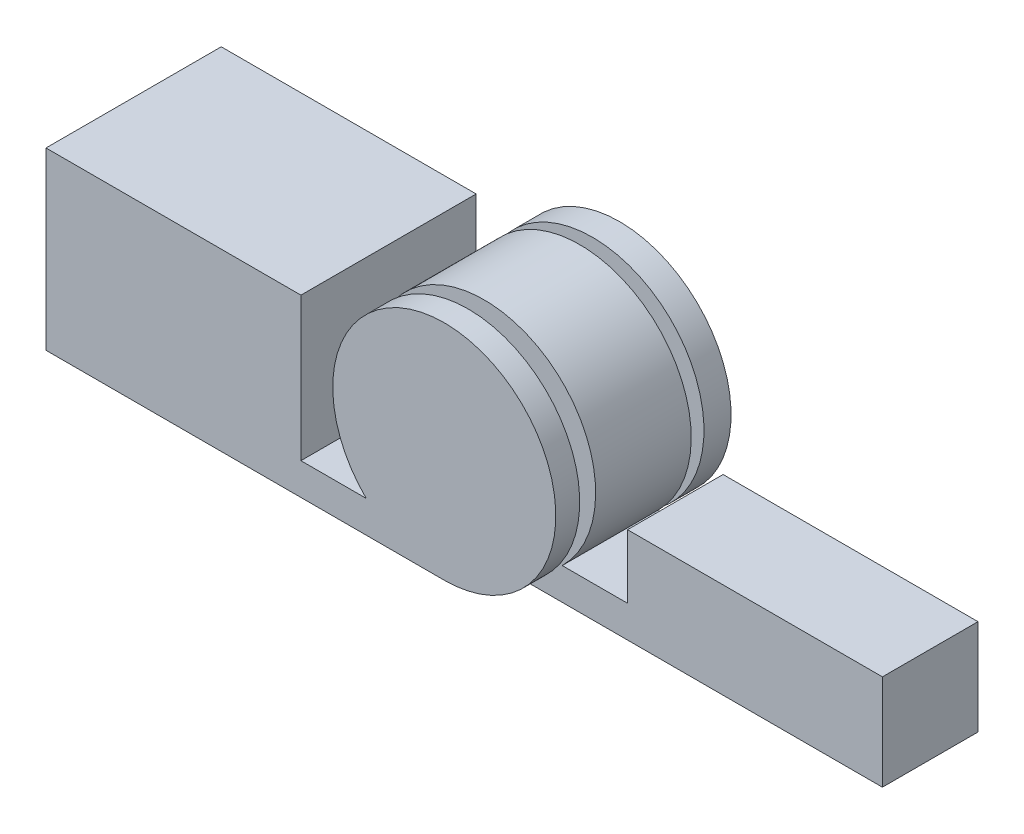
ISO-10303-21;
HEADER;
FILE_DESCRIPTION(('STEP AP214'),'2;1');
FILE_NAME('part.step','',(''),(''),'','','');
FILE_SCHEMA(('AUTOMOTIVE_DESIGN { 1 0 10303 214 1 1 1 1 }'));
ENDSEC;
DATA;
#1=APPLICATION_CONTEXT('core data for automotive mechanical design processes');
#2=APPLICATION_PROTOCOL_DEFINITION('international standard','automotive_design',2000,#1);
#3=PRODUCT_CONTEXT('',#1,'mechanical');
#4=PRODUCT('Part','Part','',(#3));
#5=PRODUCT_RELATED_PRODUCT_CATEGORY('part','',(#4));
#6=PRODUCT_DEFINITION_FORMATION('','',#4);
#7=PRODUCT_DEFINITION_CONTEXT('part definition',#1,'design');
#8=PRODUCT_DEFINITION('design','',#6,#7);
#9=PRODUCT_DEFINITION_SHAPE('','',#8);
#10=(LENGTH_UNIT() NAMED_UNIT(*) SI_UNIT(.MILLI.,.METRE.));
#11=(NAMED_UNIT(*) PLANE_ANGLE_UNIT() SI_UNIT($,.RADIAN.));
#12=(NAMED_UNIT(*) SI_UNIT($,.STERADIAN.) SOLID_ANGLE_UNIT());
#13=UNCERTAINTY_MEASURE_WITH_UNIT(LENGTH_MEASURE(1.E-05),#10,'distance_accuracy_value','');
#14=(GEOMETRIC_REPRESENTATION_CONTEXT(3) GLOBAL_UNCERTAINTY_ASSIGNED_CONTEXT((#13)) GLOBAL_UNIT_ASSIGNED_CONTEXT((#10,
#11,#12)) REPRESENTATION_CONTEXT('',''));
#15=CARTESIAN_POINT('',(0.,0.,0.));
#16=DIRECTION('',(0.,0.,1.));
#17=DIRECTION('',(1.,0.,0.));
#18=AXIS2_PLACEMENT_3D('',#15,#16,#17);
#19=CARTESIAN_POINT('',(317.5,88.9,-251.447171389936));
#20=DIRECTION('',(0.,0.,1.));
#21=DIRECTION('',(1.,0.,0.));
#22=AXIS2_PLACEMENT_3D('',#19,#20,#21);
#23=CYLINDRICAL_SURFACE('',#22,88.9);
#24=CARTESIAN_POINT('',(317.5,88.9,31.75));
#25=DIRECTION('',(0.,0.,1.));
#26=DIRECTION('',(1.,0.,0.));
#27=AXIS2_PLACEMENT_3D('',#24,#25,#26);
#28=CIRCLE('',#27,88.9);
#29=CARTESIAN_POINT('',(317.5,0.,31.75));
#30=VERTEX_POINT('',#29);
#31=CARTESIAN_POINT('',(255.282960533307,25.3999999999999,31.75));
#32=VERTEX_POINT('',#31);
#33=EDGE_CURVE('E43',#30,#32,#28,.F.);
#34=ORIENTED_EDGE('',*,*,#33,.F.);
#35=DIRECTION('',(0.,0.,1.));
#36=VECTOR('',#35,1.);
#37=CARTESIAN_POINT('',(317.5,0.,-251.447171389936));
#38=LINE('',#37,#36);
#39=CARTESIAN_POINT('',(317.5,0.,21.59));
#40=VERTEX_POINT('',#39);
#41=EDGE_CURVE('E159',#40,#30,#38,.T.);
#42=ORIENTED_EDGE('',*,*,#41,.F.);
#43=CARTESIAN_POINT('',(317.5,88.9,21.59));
#44=DIRECTION('',(0.,0.,1.));
#45=DIRECTION('',(1.,0.,0.));
#46=AXIS2_PLACEMENT_3D('',#43,#44,#45);
#47=CIRCLE('',#46,88.9);
#48=CARTESIAN_POINT('',(255.282960533307,25.3999999999999,21.59));
#49=VERTEX_POINT('',#48);
#50=EDGE_CURVE('E201',#40,#49,#47,.F.);
#51=ORIENTED_EDGE('',*,*,#50,.T.);
#52=DIRECTION('',(0.,0.,-1.));
#53=VECTOR('',#52,1.);
#54=CARTESIAN_POINT('',(255.282960533307,25.3999999999999,139.7));
#55=LINE('',#54,#53);
#56=EDGE_CURVE('E247',#32,#49,#55,.T.);
#57=ORIENTED_EDGE('',*,*,#56,.F.);
#58=EDGE_LOOP('',(#34,#42,#51,#57));
#59=FACE_BOUND('',#58,.T.);
#60=ADVANCED_FACE('F35',(#59),#23,.F.);
#61=CARTESIAN_POINT('',(317.5,88.9,139.7));
#62=DIRECTION('',(0.,0.,-1.));
#63=DIRECTION('',(-1.,0.,0.));
#64=AXIS2_PLACEMENT_3D('',#61,#62,#63);
#65=CYLINDRICAL_SURFACE('',#64,88.9);
#66=EDGE_CURVE('E200',#49,#40,#47,.F.);
#67=ORIENTED_EDGE('',*,*,#66,.T.);
#68=DIRECTION('',(0.,0.,-1.));
#69=VECTOR('',#68,1.);
#70=CARTESIAN_POINT('',(317.5,0.,139.7));
#71=LINE('',#70,#69);
#72=CARTESIAN_POINT('',(317.5,0.,0.));
#73=VERTEX_POINT('',#72);
#74=EDGE_CURVE('E245',#40,#73,#71,.T.);
#75=ORIENTED_EDGE('',*,*,#74,.T.);
#76=CARTESIAN_POINT('',(317.5,88.9,0.));
#77=DIRECTION('',(0.,0.,1.));
#78=DIRECTION('',(1.,0.,0.));
#79=AXIS2_PLACEMENT_3D('',#76,#77,#78);
#80=CIRCLE('',#79,88.9);
#81=CARTESIAN_POINT('',(255.282960533307,25.3999999999999,0.));
#82=VERTEX_POINT('',#81);
#83=EDGE_CURVE('E225',#73,#82,#80,.T.);
#84=ORIENTED_EDGE('',*,*,#83,.T.);
#85=EDGE_CURVE('E241',#49,#82,#55,.T.);
#86=ORIENTED_EDGE('',*,*,#85,.F.);
#87=EDGE_LOOP('',(#67,#75,#84,#86));
#88=FACE_BOUND('',#87,.T.);
#89=ADVANCED_FACE('F303',(#88),#65,.T.);
#90=CARTESIAN_POINT('',(0.,0.,139.7));
#91=DIRECTION('',(1.,0.,0.));
#92=DIRECTION('',(0.,0.,-1.));
#93=AXIS2_PLACEMENT_3D('',#90,#91,#92);
#94=PLANE('',#93);
#95=DIRECTION('',(0.,-1.,0.));
#96=VECTOR('',#95,1.);
#97=CARTESIAN_POINT('',(0.,0.,0.));
#98=LINE('',#97,#96);
#99=CARTESIAN_POINT('',(0.,139.7,0.));
#100=VERTEX_POINT('',#99);
#101=CARTESIAN_POINT('',(0.,0.,0.));
#102=VERTEX_POINT('',#101);
#103=EDGE_CURVE('E205',#100,#102,#98,.T.);
#104=ORIENTED_EDGE('',*,*,#103,.T.);
#105=DIRECTION('',(0.,0.,-1.));
#106=VECTOR('',#105,1.);
#107=CARTESIAN_POINT('',(0.,0.,139.7));
#108=LINE('',#107,#106);
#109=CARTESIAN_POINT('',(0.,0.,139.7));
#110=VERTEX_POINT('',#109);
#111=EDGE_CURVE('E251',#110,#102,#108,.T.);
#112=ORIENTED_EDGE('',*,*,#111,.F.);
#113=DIRECTION('',(0.,-1.,0.));
#114=VECTOR('',#113,1.);
#115=CARTESIAN_POINT('',(0.,0.,139.7));
#116=LINE('',#115,#114);
#117=CARTESIAN_POINT('',(0.,139.7,139.7));
#118=VERTEX_POINT('',#117);
#119=EDGE_CURVE('E206',#118,#110,#116,.T.);
#120=ORIENTED_EDGE('',*,*,#119,.F.);
#121=DIRECTION('',(0.,0.,-1.));
#122=VECTOR('',#121,1.);
#123=CARTESIAN_POINT('',(0.,139.7,139.7));
#124=LINE('',#123,#122);
#125=EDGE_CURVE('E220',#118,#100,#124,.T.);
#126=ORIENTED_EDGE('',*,*,#125,.T.);
#127=EDGE_LOOP('',(#104,#112,#120,#126));
#128=FACE_BOUND('',#127,.T.);
#129=ADVANCED_FACE('F37',(#128),#94,.F.);
#130=CARTESIAN_POINT('',(203.2,0.,139.7));
#131=DIRECTION('',(0.,1.,0.));
#132=DIRECTION('',(0.,0.,1.));
#133=AXIS2_PLACEMENT_3D('',#130,#131,#132);
#134=PLANE('',#133);
#135=DIRECTION('',(1.,0.,0.));
#136=VECTOR('',#135,1.);
#137=CARTESIAN_POINT('',(203.2,0.,0.));
#138=LINE('',#137,#136);
#139=EDGE_CURVE('E223',#102,#73,#138,.T.);
#140=ORIENTED_EDGE('',*,*,#139,.T.);
#141=ORIENTED_EDGE('',*,*,#74,.F.);
#142=ORIENTED_EDGE('',*,*,#41,.T.);
#143=DIRECTION('',(1.,0.,0.));
#144=VECTOR('',#143,1.);
#145=CARTESIAN_POINT('',(317.5,0.,31.75));
#146=LINE('',#145,#144);
#147=CARTESIAN_POINT('',(635.,0.,31.75));
#148=VERTEX_POINT('',#147);
#149=EDGE_CURVE('E155',#30,#148,#146,.T.);
#150=ORIENTED_EDGE('',*,*,#149,.T.);
#151=DIRECTION('',(0.,0.,-1.));
#152=VECTOR('',#151,1.);
#153=CARTESIAN_POINT('',(635.,0.,107.95));
#154=LINE('',#153,#152);
#155=CARTESIAN_POINT('',(635.,0.,107.95));
#156=VERTEX_POINT('',#155);
#157=EDGE_CURVE('E142',#156,#148,#154,.T.);
#158=ORIENTED_EDGE('',*,*,#157,.F.);
#159=DIRECTION('',(1.,0.,0.));
#160=VECTOR('',#159,1.);
#161=CARTESIAN_POINT('',(317.5,0.,107.95));
#162=LINE('',#161,#160);
#163=CARTESIAN_POINT('',(317.5,0.,107.95));
#164=VERTEX_POINT('',#163);
#165=EDGE_CURVE('E182',#164,#156,#162,.T.);
#166=ORIENTED_EDGE('',*,*,#165,.F.);
#167=CARTESIAN_POINT('',(317.5,0.,120.65));
#168=VERTEX_POINT('',#167);
#169=EDGE_CURVE('E49',#164,#168,#38,.T.);
#170=ORIENTED_EDGE('',*,*,#169,.T.);
#171=CARTESIAN_POINT('',(317.5,0.,139.7));
#172=VERTEX_POINT('',#171);
#173=EDGE_CURVE('E248',#172,#168,#71,.T.);
#174=ORIENTED_EDGE('',*,*,#173,.F.);
#175=DIRECTION('',(1.,0.,0.));
#176=VECTOR('',#175,1.);
#177=CARTESIAN_POINT('',(0.,0.,139.7));
#178=LINE('',#177,#176);
#179=EDGE_CURVE('E209',#110,#172,#178,.T.);
#180=ORIENTED_EDGE('',*,*,#179,.F.);
#181=ORIENTED_EDGE('',*,*,#111,.T.);
#182=EDGE_LOOP('',(#140,#141,#142,#150,#158,#166,#170,#174,#180,#181));
#183=FACE_BOUND('',#182,.T.);
#184=ADVANCED_FACE('F157',(#183),#134,.F.);
#185=ORIENTED_EDGE('',*,*,#173,.T.);
#186=CARTESIAN_POINT('',(317.5,88.9,120.65));
#187=DIRECTION('',(0.,0.,1.));
#188=DIRECTION('',(1.,0.,0.));
#189=AXIS2_PLACEMENT_3D('',#186,#187,#188);
#190=CIRCLE('',#189,88.9);
#191=CARTESIAN_POINT('',(255.282960533307,25.4,120.65));
#192=VERTEX_POINT('',#191);
#193=EDGE_CURVE('E151',#168,#192,#190,.T.);
#194=ORIENTED_EDGE('',*,*,#193,.T.);
#195=CARTESIAN_POINT('',(255.282960533307,25.3999999999999,139.7));
#196=VERTEX_POINT('',#195);
#197=EDGE_CURVE('E242',#196,#192,#55,.T.);
#198=ORIENTED_EDGE('',*,*,#197,.F.);
#199=CARTESIAN_POINT('',(317.5,88.9,139.7));
#200=DIRECTION('',(0.,0.,1.));
#201=DIRECTION('',(1.,0.,0.));
#202=AXIS2_PLACEMENT_3D('',#199,#200,#201);
#203=CIRCLE('',#202,88.9);
#204=EDGE_CURVE('E212',#172,#196,#203,.T.);
#205=ORIENTED_EDGE('',*,*,#204,.F.);
#206=EDGE_LOOP('',(#185,#194,#198,#205));
#207=FACE_BOUND('',#206,.T.);
#208=ADVANCED_FACE('F284',(#207),#65,.T.);
#209=CARTESIAN_POINT('',(203.2,25.4,139.7));
#210=DIRECTION('',(0.,-1.,0.));
#211=DIRECTION('',(1.,0.,0.));
#212=AXIS2_PLACEMENT_3D('',#209,#210,#211);
#213=PLANE('',#212);
#214=DIRECTION('',(-1.,0.,0.));
#215=VECTOR('',#214,1.);
#216=CARTESIAN_POINT('',(203.2,25.4,0.));
#217=LINE('',#216,#215);
#218=CARTESIAN_POINT('',(203.2,25.4,0.));
#219=VERTEX_POINT('',#218);
#220=EDGE_CURVE('E228',#82,#219,#217,.T.);
#221=ORIENTED_EDGE('',*,*,#220,.T.);
#222=DIRECTION('',(0.,0.,-1.));
#223=VECTOR('',#222,1.);
#224=CARTESIAN_POINT('',(203.2,25.4,139.7));
#225=LINE('',#224,#223);
#226=CARTESIAN_POINT('',(203.2,25.4,139.7));
#227=VERTEX_POINT('',#226);
#228=EDGE_CURVE('E238',#227,#219,#225,.T.);
#229=ORIENTED_EDGE('',*,*,#228,.F.);
#230=DIRECTION('',(-1.,0.,0.));
#231=VECTOR('',#230,1.);
#232=CARTESIAN_POINT('',(203.2,25.4,139.7));
#233=LINE('',#232,#231);
#234=EDGE_CURVE('E214',#196,#227,#233,.T.);
#235=ORIENTED_EDGE('',*,*,#234,.F.);
#236=ORIENTED_EDGE('',*,*,#197,.T.);
#237=CARTESIAN_POINT('',(255.282960533307,25.3999999999999,107.95));
#238=VERTEX_POINT('',#237);
#239=EDGE_CURVE('E246',#192,#238,#55,.T.);
#240=ORIENTED_EDGE('',*,*,#239,.T.);
#241=EDGE_CURVE('E259',#238,#32,#55,.T.);
#242=ORIENTED_EDGE('',*,*,#241,.T.);
#243=ORIENTED_EDGE('',*,*,#56,.T.);
#244=ORIENTED_EDGE('',*,*,#85,.T.);
#245=EDGE_LOOP('',(#221,#229,#235,#236,#240,#242,#243,#244));
#246=FACE_BOUND('',#245,.T.);
#247=ADVANCED_FACE('F309',(#246),#213,.F.);
#248=CARTESIAN_POINT('',(203.2,25.4,139.7));
#249=DIRECTION('',(-1.,0.,0.));
#250=DIRECTION('',(0.,0.,1.));
#251=AXIS2_PLACEMENT_3D('',#248,#249,#250);
#252=PLANE('',#251);
#253=DIRECTION('',(0.,1.,0.));
#254=VECTOR('',#253,1.);
#255=CARTESIAN_POINT('',(203.2,25.4,0.));
#256=LINE('',#255,#254);
#257=CARTESIAN_POINT('',(203.2,139.7,0.));
#258=VERTEX_POINT('',#257);
#259=EDGE_CURVE('E230',#219,#258,#256,.T.);
#260=ORIENTED_EDGE('',*,*,#259,.T.);
#261=DIRECTION('',(0.,0.,-1.));
#262=VECTOR('',#261,1.);
#263=CARTESIAN_POINT('',(203.2,139.7,139.7));
#264=LINE('',#263,#262);
#265=CARTESIAN_POINT('',(203.2,139.7,139.7));
#266=VERTEX_POINT('',#265);
#267=EDGE_CURVE('E235',#266,#258,#264,.T.);
#268=ORIENTED_EDGE('',*,*,#267,.F.);
#269=DIRECTION('',(0.,1.,0.));
#270=VECTOR('',#269,1.);
#271=CARTESIAN_POINT('',(203.2,25.4,139.7));
#272=LINE('',#271,#270);
#273=EDGE_CURVE('E216',#227,#266,#272,.T.);
#274=ORIENTED_EDGE('',*,*,#273,.F.);
#275=ORIENTED_EDGE('',*,*,#228,.T.);
#276=EDGE_LOOP('',(#260,#268,#274,#275));
#277=FACE_BOUND('',#276,.T.);
#278=ADVANCED_FACE('F313',(#277),#252,.F.);
#279=CARTESIAN_POINT('',(0.,139.7,139.7));
#280=DIRECTION('',(0.,-1.,0.));
#281=DIRECTION('',(0.,0.,-1.));
#282=AXIS2_PLACEMENT_3D('',#279,#280,#281);
#283=PLANE('',#282);
#284=DIRECTION('',(-1.,0.,0.));
#285=VECTOR('',#284,1.);
#286=CARTESIAN_POINT('',(0.,139.7,0.));
#287=LINE('',#286,#285);
#288=EDGE_CURVE('E210',#258,#100,#287,.T.);
#289=ORIENTED_EDGE('',*,*,#288,.T.);
#290=ORIENTED_EDGE('',*,*,#125,.F.);
#291=DIRECTION('',(-1.,0.,0.));
#292=VECTOR('',#291,1.);
#293=CARTESIAN_POINT('',(0.,139.7,139.7));
#294=LINE('',#293,#292);
#295=EDGE_CURVE('E218',#266,#118,#294,.T.);
#296=ORIENTED_EDGE('',*,*,#295,.F.);
#297=ORIENTED_EDGE('',*,*,#267,.T.);
#298=EDGE_LOOP('',(#289,#290,#296,#297));
#299=FACE_BOUND('',#298,.T.);
#300=ADVANCED_FACE('F316',(#299),#283,.F.);
#301=CARTESIAN_POINT('',(317.5,88.9,139.7));
#302=DIRECTION('',(0.,0.,1.));
#303=DIRECTION('',(1.,0.,0.));
#304=AXIS2_PLACEMENT_3D('',#301,#302,#303);
#305=PLANE('',#304);
#306=ORIENTED_EDGE('',*,*,#119,.T.);
#307=ORIENTED_EDGE('',*,*,#179,.T.);
#308=ORIENTED_EDGE('',*,*,#204,.T.);
#309=ORIENTED_EDGE('',*,*,#234,.T.);
#310=ORIENTED_EDGE('',*,*,#273,.T.);
#311=ORIENTED_EDGE('',*,*,#295,.T.);
#312=EDGE_LOOP('',(#306,#307,#308,#309,#310,#311));
#313=FACE_BOUND('',#312,.T.);
#314=ADVANCED_FACE('F287',(#313),#305,.T.);
#315=CARTESIAN_POINT('',(317.5,88.9,0.));
#316=DIRECTION('',(0.,0.,1.));
#317=DIRECTION('',(1.,0.,0.));
#318=AXIS2_PLACEMENT_3D('',#315,#316,#317);
#319=PLANE('',#318);
#320=ORIENTED_EDGE('',*,*,#103,.F.);
#321=ORIENTED_EDGE('',*,*,#288,.F.);
#322=ORIENTED_EDGE('',*,*,#259,.F.);
#323=ORIENTED_EDGE('',*,*,#220,.F.);
#324=ORIENTED_EDGE('',*,*,#83,.F.);
#325=ORIENTED_EDGE('',*,*,#139,.F.);
#326=EDGE_LOOP('',(#320,#321,#322,#323,#324,#325));
#327=FACE_BOUND('',#326,.T.);
#328=ADVANCED_FACE('F297',(#327),#319,.F.);
#329=ORIENTED_EDGE('',*,*,#169,.F.);
#330=CARTESIAN_POINT('',(317.5,88.9,107.95));
#331=DIRECTION('',(0.,0.,1.));
#332=DIRECTION('',(1.,0.,0.));
#333=AXIS2_PLACEMENT_3D('',#330,#331,#332);
#334=CIRCLE('',#333,88.9);
#335=EDGE_CURVE('E12',#164,#238,#334,.F.);
#336=ORIENTED_EDGE('',*,*,#335,.T.);
#337=ORIENTED_EDGE('',*,*,#239,.F.);
#338=EDGE_CURVE('E198',#192,#168,#190,.T.);
#339=ORIENTED_EDGE('',*,*,#338,.T.);
#340=EDGE_LOOP('',(#329,#336,#337,#339));
#341=FACE_BOUND('',#340,.T.);
#342=ADVANCED_FACE('F282',(#341),#23,.F.);
#343=CARTESIAN_POINT('',(317.5,88.9,21.59));
#344=DIRECTION('',(0.,0.,1.));
#345=DIRECTION('',(1.,0.,0.));
#346=AXIS2_PLACEMENT_3D('',#343,#344,#345);
#347=PLANE('',#346);
#348=ORIENTED_EDGE('',*,*,#50,.F.);
#349=ORIENTED_EDGE('',*,*,#66,.F.);
#350=EDGE_LOOP('',(#348,#349));
#351=FACE_BOUND('',#350,.T.);
#352=ADVANCED_FACE('F307',(#351),#347,.T.);
#353=CARTESIAN_POINT('',(317.5,88.9,120.65));
#354=DIRECTION('',(0.,0.,1.));
#355=DIRECTION('',(1.,0.,0.));
#356=AXIS2_PLACEMENT_3D('',#353,#354,#355);
#357=PLANE('',#356);
#358=ORIENTED_EDGE('',*,*,#338,.F.);
#359=ORIENTED_EDGE('',*,*,#193,.F.);
#360=EDGE_LOOP('',(#358,#359));
#361=FACE_BOUND('',#360,.T.);
#362=ADVANCED_FACE('F279',(#361),#357,.F.);
#363=CARTESIAN_POINT('',(317.5,88.9,107.95));
#364=DIRECTION('',(0.,0.,-1.));
#365=DIRECTION('',(-1.,0.,0.));
#366=AXIS2_PLACEMENT_3D('',#363,#364,#365);
#367=CYLINDRICAL_SURFACE('',#366,88.9);
#368=CARTESIAN_POINT('',(317.5,88.9,31.75));
#369=DIRECTION('',(0.,0.,1.));
#370=DIRECTION('',(1.,0.,0.));
#371=AXIS2_PLACEMENT_3D('',#368,#369,#370);
#372=CIRCLE('',#371,88.9);
#373=CARTESIAN_POINT('',(379.717039466693,25.4,31.75));
#374=VERTEX_POINT('',#373);
#375=EDGE_CURVE('E161',#374,#32,#372,.T.);
#376=ORIENTED_EDGE('',*,*,#375,.T.);
#377=ORIENTED_EDGE('',*,*,#241,.F.);
#378=CARTESIAN_POINT('',(317.5,88.9,107.95));
#379=DIRECTION('',(0.,0.,1.));
#380=DIRECTION('',(1.,0.,0.));
#381=AXIS2_PLACEMENT_3D('',#378,#379,#380);
#382=CIRCLE('',#381,88.9);
#383=CARTESIAN_POINT('',(379.717039466693,25.4,107.95));
#384=VERTEX_POINT('',#383);
#385=EDGE_CURVE('E179',#384,#238,#382,.T.);
#386=ORIENTED_EDGE('',*,*,#385,.F.);
#387=DIRECTION('',(0.,0.,-1.));
#388=VECTOR('',#387,1.);
#389=CARTESIAN_POINT('',(379.717039466693,25.4,107.95));
#390=LINE('',#389,#388);
#391=EDGE_CURVE('E191',#384,#374,#390,.T.);
#392=ORIENTED_EDGE('',*,*,#391,.T.);
#393=EDGE_LOOP('',(#376,#377,#386,#392));
#394=FACE_BOUND('',#393,.T.);
#395=ADVANCED_FACE('F257',(#394),#367,.T.);
#396=CARTESIAN_POINT('',(635.,0.,107.95));
#397=DIRECTION('',(-1.,0.,0.));
#398=DIRECTION('',(0.,0.,1.));
#399=AXIS2_PLACEMENT_3D('',#396,#397,#398);
#400=PLANE('',#399);
#401=ORIENTED_EDGE('',*,*,#157,.T.);
#402=DIRECTION('',(0.,1.,0.));
#403=VECTOR('',#402,1.);
#404=CARTESIAN_POINT('',(635.,0.,31.75));
#405=LINE('',#404,#403);
#406=CARTESIAN_POINT('',(635.,76.2,31.75));
#407=VERTEX_POINT('',#406);
#408=EDGE_CURVE('E147',#148,#407,#405,.T.);
#409=ORIENTED_EDGE('',*,*,#408,.T.);
#410=DIRECTION('',(0.,0.,-1.));
#411=VECTOR('',#410,1.);
#412=CARTESIAN_POINT('',(635.,76.2,107.95));
#413=LINE('',#412,#411);
#414=CARTESIAN_POINT('',(635.,76.2,107.95));
#415=VERTEX_POINT('',#414);
#416=EDGE_CURVE('E152',#415,#407,#413,.T.);
#417=ORIENTED_EDGE('',*,*,#416,.F.);
#418=DIRECTION('',(0.,1.,0.));
#419=VECTOR('',#418,1.);
#420=CARTESIAN_POINT('',(635.,0.,107.95));
#421=LINE('',#420,#419);
#422=EDGE_CURVE('E148',#156,#415,#421,.T.);
#423=ORIENTED_EDGE('',*,*,#422,.F.);
#424=EDGE_LOOP('',(#401,#409,#417,#423));
#425=FACE_BOUND('',#424,.T.);
#426=ADVANCED_FACE('F144',(#425),#400,.F.);
#427=CARTESIAN_POINT('',(431.8,76.2,107.95));
#428=DIRECTION('',(0.,-1.,0.));
#429=DIRECTION('',(0.,0.,-1.));
#430=AXIS2_PLACEMENT_3D('',#427,#428,#429);
#431=PLANE('',#430);
#432=ORIENTED_EDGE('',*,*,#416,.T.);
#433=DIRECTION('',(-1.,0.,0.));
#434=VECTOR('',#433,1.);
#435=CARTESIAN_POINT('',(431.8,76.2,31.75));
#436=LINE('',#435,#434);
#437=CARTESIAN_POINT('',(431.8,76.2,31.75));
#438=VERTEX_POINT('',#437);
#439=EDGE_CURVE('E168',#407,#438,#436,.T.);
#440=ORIENTED_EDGE('',*,*,#439,.T.);
#441=DIRECTION('',(0.,0.,-1.));
#442=VECTOR('',#441,1.);
#443=CARTESIAN_POINT('',(431.8,76.2,107.95));
#444=LINE('',#443,#442);
#445=CARTESIAN_POINT('',(431.8,76.2,107.95));
#446=VERTEX_POINT('',#445);
#447=EDGE_CURVE('E195',#446,#438,#444,.T.);
#448=ORIENTED_EDGE('',*,*,#447,.F.);
#449=DIRECTION('',(-1.,0.,0.));
#450=VECTOR('',#449,1.);
#451=CARTESIAN_POINT('',(431.8,76.2,107.95));
#452=LINE('',#451,#450);
#453=EDGE_CURVE('E185',#415,#446,#452,.T.);
#454=ORIENTED_EDGE('',*,*,#453,.F.);
#455=EDGE_LOOP('',(#432,#440,#448,#454));
#456=FACE_BOUND('',#455,.T.);
#457=ADVANCED_FACE('F268',(#456),#431,.F.);
#458=CARTESIAN_POINT('',(431.8,25.4,107.95));
#459=DIRECTION('',(1.,0.,0.));
#460=DIRECTION('',(0.,0.,-1.));
#461=AXIS2_PLACEMENT_3D('',#458,#459,#460);
#462=PLANE('',#461);
#463=ORIENTED_EDGE('',*,*,#447,.T.);
#464=DIRECTION('',(0.,-1.,0.));
#465=VECTOR('',#464,1.);
#466=CARTESIAN_POINT('',(431.8,25.4,31.75));
#467=LINE('',#466,#465);
#468=CARTESIAN_POINT('',(431.8,25.4,31.75));
#469=VERTEX_POINT('',#468);
#470=EDGE_CURVE('E170',#438,#469,#467,.T.);
#471=ORIENTED_EDGE('',*,*,#470,.T.);
#472=DIRECTION('',(0.,0.,-1.));
#473=VECTOR('',#472,1.);
#474=CARTESIAN_POINT('',(431.8,25.4,107.95));
#475=LINE('',#474,#473);
#476=CARTESIAN_POINT('',(431.8,25.4,107.95));
#477=VERTEX_POINT('',#476);
#478=EDGE_CURVE('E193',#477,#469,#475,.T.);
#479=ORIENTED_EDGE('',*,*,#478,.F.);
#480=DIRECTION('',(0.,-1.,0.));
#481=VECTOR('',#480,1.);
#482=CARTESIAN_POINT('',(431.8,25.4,107.95));
#483=LINE('',#482,#481);
#484=EDGE_CURVE('E187',#446,#477,#483,.T.);
#485=ORIENTED_EDGE('',*,*,#484,.F.);
#486=EDGE_LOOP('',(#463,#471,#479,#485));
#487=FACE_BOUND('',#486,.T.);
#488=ADVANCED_FACE('F415',(#487),#462,.F.);
#489=CARTESIAN_POINT('',(379.717039466693,25.4,107.95));
#490=DIRECTION('',(0.,-1.,0.));
#491=DIRECTION('',(1.,0.,0.));
#492=AXIS2_PLACEMENT_3D('',#489,#490,#491);
#493=PLANE('',#492);
#494=ORIENTED_EDGE('',*,*,#478,.T.);
#495=DIRECTION('',(-1.,0.,0.));
#496=VECTOR('',#495,1.);
#497=CARTESIAN_POINT('',(379.717039466693,25.4,31.75));
#498=LINE('',#497,#496);
#499=EDGE_CURVE('E176',#469,#374,#498,.T.);
#500=ORIENTED_EDGE('',*,*,#499,.T.);
#501=ORIENTED_EDGE('',*,*,#391,.F.);
#502=DIRECTION('',(-1.,0.,0.));
#503=VECTOR('',#502,1.);
#504=CARTESIAN_POINT('',(379.717039466693,25.4,107.95));
#505=LINE('',#504,#503);
#506=EDGE_CURVE('E189',#477,#384,#505,.T.);
#507=ORIENTED_EDGE('',*,*,#506,.F.);
#508=EDGE_LOOP('',(#494,#500,#501,#507));
#509=FACE_BOUND('',#508,.T.);
#510=ADVANCED_FACE('F263',(#509),#493,.F.);
#511=CARTESIAN_POINT('',(317.5,88.9,107.95));
#512=DIRECTION('',(0.,0.,1.));
#513=DIRECTION('',(1.,0.,0.));
#514=AXIS2_PLACEMENT_3D('',#511,#512,#513);
#515=PLANE('',#514);
#516=ORIENTED_EDGE('',*,*,#385,.T.);
#517=ORIENTED_EDGE('',*,*,#335,.F.);
#518=ORIENTED_EDGE('',*,*,#165,.T.);
#519=ORIENTED_EDGE('',*,*,#422,.T.);
#520=ORIENTED_EDGE('',*,*,#453,.T.);
#521=ORIENTED_EDGE('',*,*,#484,.T.);
#522=ORIENTED_EDGE('',*,*,#506,.T.);
#523=EDGE_LOOP('',(#516,#517,#518,#519,#520,#521,#522));
#524=FACE_BOUND('',#523,.T.);
#525=ADVANCED_FACE('F272',(#524),#515,.T.);
#526=CARTESIAN_POINT('',(317.5,88.9,31.75));
#527=DIRECTION('',(0.,0.,1.));
#528=DIRECTION('',(1.,0.,0.));
#529=AXIS2_PLACEMENT_3D('',#526,#527,#528);
#530=PLANE('',#529);
#531=ORIENTED_EDGE('',*,*,#375,.F.);
#532=ORIENTED_EDGE('',*,*,#499,.F.);
#533=ORIENTED_EDGE('',*,*,#470,.F.);
#534=ORIENTED_EDGE('',*,*,#439,.F.);
#535=ORIENTED_EDGE('',*,*,#408,.F.);
#536=ORIENTED_EDGE('',*,*,#149,.F.);
#537=ORIENTED_EDGE('',*,*,#33,.T.);
#538=EDGE_LOOP('',(#531,#532,#533,#534,#535,#536,#537));
#539=FACE_BOUND('',#538,.T.);
#540=ADVANCED_FACE('F165',(#539),#530,.F.);
#541=CLOSED_SHELL('',(#60,#89,#129,#184,#208,#247,#278,#300,#314,#328,#342,#352,#362,#395,#426,
#457,#488,#510,#525,#540));
#542=MANIFOLD_SOLID_BREP('B2',#541);
#543=ADVANCED_BREP_SHAPE_REPRESENTATION('',(#18,#542),#14);
#544=SHAPE_DEFINITION_REPRESENTATION(#9,#543);
ENDSEC;
END-ISO-10303-21;
